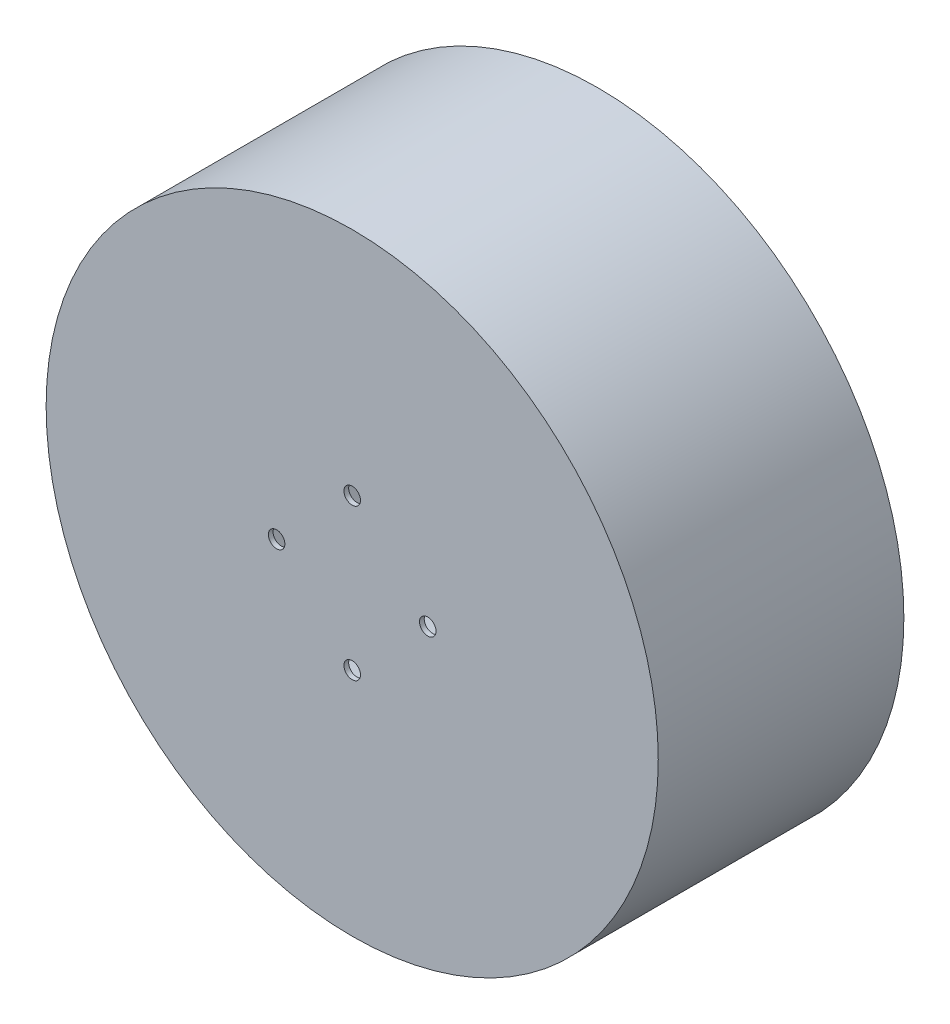
ISO-10303-21;
HEADER;
FILE_DESCRIPTION(('STEP AP214'),'2;1');
FILE_NAME('part.step','',(''),(''),'','','');
FILE_SCHEMA(('AUTOMOTIVE_DESIGN { 1 0 10303 214 1 1 1 1 }'));
ENDSEC;
DATA;
#1=APPLICATION_CONTEXT('core data for automotive mechanical design processes');
#2=APPLICATION_PROTOCOL_DEFINITION('international standard','automotive_design',2000,#1);
#3=PRODUCT_CONTEXT('',#1,'mechanical');
#4=PRODUCT('Part','Part','',(#3));
#5=PRODUCT_RELATED_PRODUCT_CATEGORY('part','',(#4));
#6=PRODUCT_DEFINITION_FORMATION('','',#4);
#7=PRODUCT_DEFINITION_CONTEXT('part definition',#1,'design');
#8=PRODUCT_DEFINITION('design','',#6,#7);
#9=PRODUCT_DEFINITION_SHAPE('','',#8);
#10=(LENGTH_UNIT() NAMED_UNIT(*) SI_UNIT(.MILLI.,.METRE.));
#11=(NAMED_UNIT(*) PLANE_ANGLE_UNIT() SI_UNIT($,.RADIAN.));
#12=(NAMED_UNIT(*) SI_UNIT($,.STERADIAN.) SOLID_ANGLE_UNIT());
#13=UNCERTAINTY_MEASURE_WITH_UNIT(LENGTH_MEASURE(1.E-05),#10,'distance_accuracy_value','');
#14=(GEOMETRIC_REPRESENTATION_CONTEXT(3) GLOBAL_UNCERTAINTY_ASSIGNED_CONTEXT((#13)) GLOBAL_UNIT_ASSIGNED_CONTEXT((#10,
#11,#12)) REPRESENTATION_CONTEXT('',''));
#15=CARTESIAN_POINT('',(0.,0.,0.));
#16=DIRECTION('',(0.,0.,1.));
#17=DIRECTION('',(1.,0.,0.));
#18=AXIS2_PLACEMENT_3D('',#15,#16,#17);
#19=CARTESIAN_POINT('',(0.,0.,3.17499999999993));
#20=DIRECTION('',(0.,0.,0.999999999999996));
#21=DIRECTION('',(1.,0.,0.));
#22=AXIS2_PLACEMENT_3D('',#19,#20,#21);
#23=PLANE('',#22);
#24=CARTESIAN_POINT('',(-3.53883589099269E-13,-50.8,3.17499999999993));
#25=DIRECTION('',(0.,0.,0.999999999999996));
#26=DIRECTION('',(1.,0.,0.));
#27=AXIS2_PLACEMENT_3D('',#24,#25,#26);
#28=CIRCLE('',#27,5.55625);
#29=CARTESIAN_POINT('',(5.55624999999965,-50.8,3.17499999999993));
#30=VERTEX_POINT('',#29);
#31=EDGE_CURVE('E67',#30,#30,#28,.T.);
#32=ORIENTED_EDGE('',*,*,#31,.F.);
#33=EDGE_LOOP('',(#32));
#34=FACE_BOUND('',#33,.T.);
#35=CARTESIAN_POINT('',(0.,50.8,3.17499999999993));
#36=DIRECTION('',(0.,0.,0.999999999999996));
#37=DIRECTION('',(1.,0.,0.));
#38=AXIS2_PLACEMENT_3D('',#35,#36,#37);
#39=CIRCLE('',#38,5.55625);
#40=CARTESIAN_POINT('',(5.55625,50.8,3.17499999999993));
#41=VERTEX_POINT('',#40);
#42=EDGE_CURVE('E53',#41,#41,#39,.T.);
#43=ORIENTED_EDGE('',*,*,#42,.F.);
#44=EDGE_LOOP('',(#43));
#45=FACE_BOUND('',#44,.T.);
#46=CARTESIAN_POINT('',(50.8,1.38777878078145E-13,3.17499999999993));
#47=DIRECTION('',(0.,0.,0.999999999999996));
#48=DIRECTION('',(1.,0.,0.));
#49=AXIS2_PLACEMENT_3D('',#46,#47,#48);
#50=CIRCLE('',#49,5.55625);
#51=CARTESIAN_POINT('',(56.35625,1.38777878078145E-13,3.17499999999993));
#52=VERTEX_POINT('',#51);
#53=EDGE_CURVE('E62',#52,#52,#50,.T.);
#54=ORIENTED_EDGE('',*,*,#53,.F.);
#55=EDGE_LOOP('',(#54));
#56=FACE_BOUND('',#55,.T.);
#57=CARTESIAN_POINT('',(-50.8,5.55111512312578E-13,3.17499999999993));
#58=DIRECTION('',(0.,0.,0.999999999999996));
#59=DIRECTION('',(1.,0.,0.));
#60=AXIS2_PLACEMENT_3D('',#57,#58,#59);
#61=CIRCLE('',#60,5.55625);
#62=CARTESIAN_POINT('',(-45.24375,5.55111512312578E-13,3.17499999999993));
#63=VERTEX_POINT('',#62);
#64=EDGE_CURVE('E73',#63,#63,#61,.T.);
#65=ORIENTED_EDGE('',*,*,#64,.F.);
#66=EDGE_LOOP('',(#65));
#67=FACE_BOUND('',#66,.T.);
#68=CARTESIAN_POINT('',(0.,0.,3.17499999999993));
#69=DIRECTION('',(0.,0.,0.999999999999996));
#70=DIRECTION('',(1.,0.,0.));
#71=AXIS2_PLACEMENT_3D('',#68,#69,#70);
#72=CIRCLE('',#71,205.74);
#73=CARTESIAN_POINT('',(205.74,0.,3.17499999999993));
#74=VERTEX_POINT('',#73);
#75=EDGE_CURVE('E82',#74,#74,#72,.T.);
#76=ORIENTED_EDGE('',*,*,#75,.T.);
#77=EDGE_LOOP('',(#76));
#78=FACE_BOUND('',#77,.T.);
#79=ADVANCED_FACE('F46',(#34,#45,#56,#67,#78),#23,.T.);
#80=CARTESIAN_POINT('',(0.,0.,0.));
#81=DIRECTION('',(0.,0.,0.999999999999996));
#82=DIRECTION('',(1.,0.,0.));
#83=AXIS2_PLACEMENT_3D('',#80,#81,#82);
#84=PLANE('',#83);
#85=CARTESIAN_POINT('',(0.,0.,0.));
#86=DIRECTION('',(0.,0.,0.999999999999996));
#87=DIRECTION('',(1.,0.,0.));
#88=AXIS2_PLACEMENT_3D('',#85,#86,#87);
#89=CIRCLE('',#88,101.6);
#90=CARTESIAN_POINT('',(101.6,0.,0.));
#91=VERTEX_POINT('',#90);
#92=EDGE_CURVE('E12',#91,#91,#89,.T.);
#93=ORIENTED_EDGE('',*,*,#92,.F.);
#94=EDGE_LOOP('',(#93));
#95=FACE_BOUND('',#94,.T.);
#96=CARTESIAN_POINT('',(0.,50.8,0.));
#97=DIRECTION('',(0.,0.,0.999999999999996));
#98=DIRECTION('',(1.,0.,0.));
#99=AXIS2_PLACEMENT_3D('',#96,#97,#98);
#100=CIRCLE('',#99,5.55625);
#101=CARTESIAN_POINT('',(5.55625,50.8,0.));
#102=VERTEX_POINT('',#101);
#103=EDGE_CURVE('E57',#102,#102,#100,.T.);
#104=ORIENTED_EDGE('',*,*,#103,.T.);
#105=EDGE_LOOP('',(#104));
#106=FACE_BOUND('',#105,.T.);
#107=CARTESIAN_POINT('',(50.8,1.38777878078145E-13,0.));
#108=DIRECTION('',(0.,0.,0.999999999999996));
#109=DIRECTION('',(1.,0.,0.));
#110=AXIS2_PLACEMENT_3D('',#107,#108,#109);
#111=CIRCLE('',#110,5.55625);
#112=CARTESIAN_POINT('',(56.35625,1.38777878078145E-13,0.));
#113=VERTEX_POINT('',#112);
#114=EDGE_CURVE('E64',#113,#113,#111,.T.);
#115=ORIENTED_EDGE('',*,*,#114,.T.);
#116=EDGE_LOOP('',(#115));
#117=FACE_BOUND('',#116,.T.);
#118=CARTESIAN_POINT('',(-3.53883589099269E-13,-50.8,0.));
#119=DIRECTION('',(0.,0.,0.999999999999996));
#120=DIRECTION('',(1.,0.,0.));
#121=AXIS2_PLACEMENT_3D('',#118,#119,#120);
#122=CIRCLE('',#121,5.55625);
#123=CARTESIAN_POINT('',(5.55624999999965,-50.8,0.));
#124=VERTEX_POINT('',#123);
#125=EDGE_CURVE('E70',#124,#124,#122,.T.);
#126=ORIENTED_EDGE('',*,*,#125,.T.);
#127=EDGE_LOOP('',(#126));
#128=FACE_BOUND('',#127,.T.);
#129=CARTESIAN_POINT('',(-50.8,5.55111512312578E-13,0.));
#130=DIRECTION('',(0.,0.,0.999999999999996));
#131=DIRECTION('',(1.,0.,0.));
#132=AXIS2_PLACEMENT_3D('',#129,#130,#131);
#133=CIRCLE('',#132,5.55625);
#134=CARTESIAN_POINT('',(-45.24375,5.55111512312578E-13,0.));
#135=VERTEX_POINT('',#134);
#136=EDGE_CURVE('E76',#135,#135,#133,.T.);
#137=ORIENTED_EDGE('',*,*,#136,.T.);
#138=EDGE_LOOP('',(#137));
#139=FACE_BOUND('',#138,.T.);
#140=ADVANCED_FACE('F48',(#95,#106,#117,#128,#139),#84,.F.);
#141=CARTESIAN_POINT('',(0.,50.8,3.17499999999993));
#142=DIRECTION('',(0.,0.,-0.999999999999996));
#143=DIRECTION('',(-1.,0.,0.));
#144=AXIS2_PLACEMENT_3D('',#141,#142,#143);
#145=CYLINDRICAL_SURFACE('',#144,5.55625);
#146=ORIENTED_EDGE('',*,*,#42,.T.);
#147=EDGE_LOOP('',(#146));
#148=FACE_BOUND('',#147,.T.);
#149=ORIENTED_EDGE('',*,*,#103,.F.);
#150=EDGE_LOOP('',(#149));
#151=FACE_BOUND('',#150,.T.);
#152=ADVANCED_FACE('F114',(#148,#151),#145,.F.);
#153=CARTESIAN_POINT('',(50.8,1.38777878078145E-13,3.17499999999993));
#154=DIRECTION('',(0.,0.,-0.999999999999996));
#155=DIRECTION('',(-1.,0.,0.));
#156=AXIS2_PLACEMENT_3D('',#153,#154,#155);
#157=CYLINDRICAL_SURFACE('',#156,5.55625);
#158=ORIENTED_EDGE('',*,*,#53,.T.);
#159=EDGE_LOOP('',(#158));
#160=FACE_BOUND('',#159,.T.);
#161=ORIENTED_EDGE('',*,*,#114,.F.);
#162=EDGE_LOOP('',(#161));
#163=FACE_BOUND('',#162,.T.);
#164=ADVANCED_FACE('F121',(#160,#163),#157,.F.);
#165=CARTESIAN_POINT('',(-3.53883589099269E-13,-50.8,3.17499999999993));
#166=DIRECTION('',(0.,0.,-0.999999999999996));
#167=DIRECTION('',(-1.,0.,0.));
#168=AXIS2_PLACEMENT_3D('',#165,#166,#167);
#169=CYLINDRICAL_SURFACE('',#168,5.55625);
#170=ORIENTED_EDGE('',*,*,#31,.T.);
#171=EDGE_LOOP('',(#170));
#172=FACE_BOUND('',#171,.T.);
#173=ORIENTED_EDGE('',*,*,#125,.F.);
#174=EDGE_LOOP('',(#173));
#175=FACE_BOUND('',#174,.T.);
#176=ADVANCED_FACE('F105',(#172,#175),#169,.F.);
#177=CARTESIAN_POINT('',(-50.8,5.55111512312578E-13,3.17499999999993));
#178=DIRECTION('',(0.,0.,-0.999999999999996));
#179=DIRECTION('',(-1.,0.,0.));
#180=AXIS2_PLACEMENT_3D('',#177,#178,#179);
#181=CYLINDRICAL_SURFACE('',#180,5.55625);
#182=ORIENTED_EDGE('',*,*,#64,.T.);
#183=EDGE_LOOP('',(#182));
#184=FACE_BOUND('',#183,.T.);
#185=ORIENTED_EDGE('',*,*,#136,.F.);
#186=EDGE_LOOP('',(#185));
#187=FACE_BOUND('',#186,.T.);
#188=ADVANCED_FACE('F97',(#184,#187),#181,.F.);
#189=CARTESIAN_POINT('',(0.,0.,-161.924999999999));
#190=DIRECTION('',(0.,0.,0.999999999999996));
#191=DIRECTION('',(1.,0.,0.));
#192=AXIS2_PLACEMENT_3D('',#189,#190,#191);
#193=CYLINDRICAL_SURFACE('',#192,101.6);
#194=CARTESIAN_POINT('',(0.,0.,-161.924999999999));
#195=DIRECTION('',(0.,0.,0.999999999999996));
#196=DIRECTION('',(1.,0.,0.));
#197=AXIS2_PLACEMENT_3D('',#194,#195,#196);
#198=CIRCLE('',#197,101.6);
#199=CARTESIAN_POINT('',(101.6,0.,-161.924999999999));
#200=VERTEX_POINT('',#199);
#201=EDGE_CURVE('E85',#200,#200,#198,.T.);
#202=ORIENTED_EDGE('',*,*,#201,.F.);
#203=EDGE_LOOP('',(#202));
#204=FACE_BOUND('',#203,.T.);
#205=ORIENTED_EDGE('',*,*,#92,.T.);
#206=EDGE_LOOP('',(#205));
#207=FACE_BOUND('',#206,.T.);
#208=ADVANCED_FACE('F94',(#204,#207),#193,.F.);
#209=CARTESIAN_POINT('',(0.,0.,-161.924999999999));
#210=DIRECTION('',(0.,0.,0.999999999999996));
#211=DIRECTION('',(1.,0.,0.));
#212=AXIS2_PLACEMENT_3D('',#209,#210,#211);
#213=CYLINDRICAL_SURFACE('',#212,205.74);
#214=CARTESIAN_POINT('',(0.,0.,-161.924999999999));
#215=DIRECTION('',(0.,0.,0.999999999999996));
#216=DIRECTION('',(1.,0.,0.));
#217=AXIS2_PLACEMENT_3D('',#214,#215,#216);
#218=CIRCLE('',#217,205.74);
#219=CARTESIAN_POINT('',(205.74,0.,-161.924999999999));
#220=VERTEX_POINT('',#219);
#221=EDGE_CURVE('E79',#220,#220,#218,.T.);
#222=ORIENTED_EDGE('',*,*,#221,.T.);
#223=EDGE_LOOP('',(#222));
#224=FACE_BOUND('',#223,.T.);
#225=ORIENTED_EDGE('',*,*,#75,.F.);
#226=EDGE_LOOP('',(#225));
#227=FACE_BOUND('',#226,.T.);
#228=ADVANCED_FACE('F96',(#224,#227),#213,.T.);
#229=CARTESIAN_POINT('',(0.,0.,-161.924999999999));
#230=DIRECTION('',(0.,0.,0.999999999999996));
#231=DIRECTION('',(1.,0.,0.));
#232=AXIS2_PLACEMENT_3D('',#229,#230,#231);
#233=PLANE('',#232);
#234=ORIENTED_EDGE('',*,*,#201,.T.);
#235=EDGE_LOOP('',(#234));
#236=FACE_BOUND('',#235,.T.);
#237=ORIENTED_EDGE('',*,*,#221,.F.);
#238=EDGE_LOOP('',(#237));
#239=FACE_BOUND('',#238,.T.);
#240=ADVANCED_FACE('F91',(#236,#239),#233,.F.);
#241=CLOSED_SHELL('',(#79,#140,#152,#164,#176,#188,#208,#228,#240));
#242=MANIFOLD_SOLID_BREP('B2',#241);
#243=ADVANCED_BREP_SHAPE_REPRESENTATION('',(#18,#242),#14);
#244=SHAPE_DEFINITION_REPRESENTATION(#9,#243);
ENDSEC;
END-ISO-10303-21;
